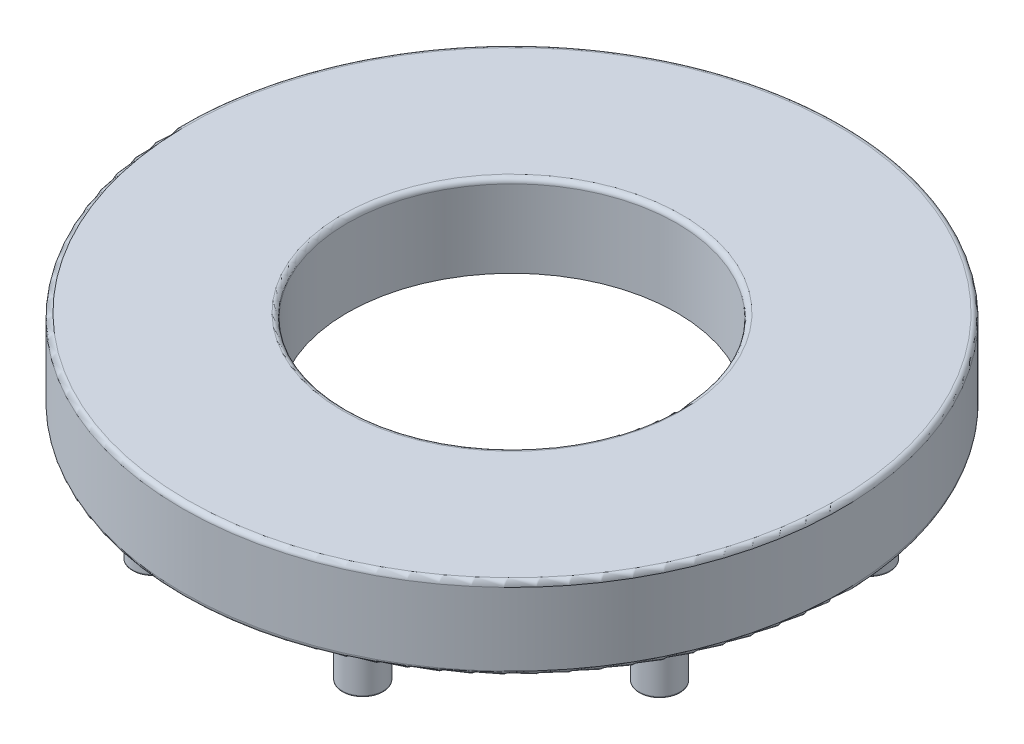
ISO-10303-21;
HEADER;
FILE_DESCRIPTION(('STEP AP214'),'2;1');
FILE_NAME('part.step','',(''),(''),'','','');
FILE_SCHEMA(('AUTOMOTIVE_DESIGN { 1 0 10303 214 1 1 1 1 }'));
ENDSEC;
DATA;
#1=APPLICATION_CONTEXT('core data for automotive mechanical design processes');
#2=APPLICATION_PROTOCOL_DEFINITION('international standard','automotive_design',2000,#1);
#3=PRODUCT_CONTEXT('',#1,'mechanical');
#4=PRODUCT('Part','Part','',(#3));
#5=PRODUCT_RELATED_PRODUCT_CATEGORY('part','',(#4));
#6=PRODUCT_DEFINITION_FORMATION('','',#4);
#7=PRODUCT_DEFINITION_CONTEXT('part definition',#1,'design');
#8=PRODUCT_DEFINITION('design','',#6,#7);
#9=PRODUCT_DEFINITION_SHAPE('','',#8);
#10=(LENGTH_UNIT() NAMED_UNIT(*) SI_UNIT(.MILLI.,.METRE.));
#11=(NAMED_UNIT(*) PLANE_ANGLE_UNIT() SI_UNIT($,.RADIAN.));
#12=(NAMED_UNIT(*) SI_UNIT($,.STERADIAN.) SOLID_ANGLE_UNIT());
#13=UNCERTAINTY_MEASURE_WITH_UNIT(LENGTH_MEASURE(1.E-05),#10,'distance_accuracy_value','');
#14=(GEOMETRIC_REPRESENTATION_CONTEXT(3) GLOBAL_UNCERTAINTY_ASSIGNED_CONTEXT((#13)) GLOBAL_UNIT_ASSIGNED_CONTEXT((#10,
#11,#12)) REPRESENTATION_CONTEXT('',''));
#15=CARTESIAN_POINT('',(0.,0.,0.));
#16=DIRECTION('',(0.,0.,1.));
#17=DIRECTION('',(1.,0.,0.));
#18=AXIS2_PLACEMENT_3D('',#15,#16,#17);
#19=CARTESIAN_POINT('',(0.,500.,0.));
#20=DIRECTION('',(0.,1.,0.));
#21=DIRECTION('',(0.,0.,1.));
#22=AXIS2_PLACEMENT_3D('',#19,#20,#21);
#23=PLANE('',#22);
#24=CARTESIAN_POINT('',(0.,500.,0.));
#25=DIRECTION('',(0.,1.,0.));
#26=DIRECTION('',(0.,0.,1.));
#27=AXIS2_PLACEMENT_3D('',#24,#25,#26);
#28=CIRCLE('',#27,1970.);
#29=CARTESIAN_POINT('',(0.,500.,1970.));
#30=VERTEX_POINT('',#29);
#31=EDGE_CURVE('E95',#30,#30,#28,.T.);
#32=ORIENTED_EDGE('',*,*,#31,.T.);
#33=EDGE_LOOP('',(#32));
#34=FACE_BOUND('',#33,.T.);
#35=CARTESIAN_POINT('',(0.,500.,0.));
#36=DIRECTION('',(0.,1.,0.));
#37=DIRECTION('',(0.,0.,1.));
#38=AXIS2_PLACEMENT_3D('',#35,#36,#37);
#39=CIRCLE('',#38,1030.);
#40=CARTESIAN_POINT('',(0.,500.,1030.));
#41=VERTEX_POINT('',#40);
#42=EDGE_CURVE('E98',#41,#41,#39,.F.);
#43=ORIENTED_EDGE('',*,*,#42,.T.);
#44=EDGE_LOOP('',(#43));
#45=FACE_BOUND('',#44,.T.);
#46=ADVANCED_FACE('F36',(#34,#45),#23,.T.);
#47=CARTESIAN_POINT('',(0.,0.,0.));
#48=DIRECTION('',(0.,1.,0.));
#49=DIRECTION('',(0.,0.,1.));
#50=AXIS2_PLACEMENT_3D('',#47,#48,#49);
#51=PLANE('',#50);
#52=CARTESIAN_POINT('',(0.,0.,0.));
#53=DIRECTION('',(0.,1.,0.));
#54=DIRECTION('',(0.,0.,1.));
#55=AXIS2_PLACEMENT_3D('',#52,#53,#54);
#56=CIRCLE('',#55,1970.);
#57=CARTESIAN_POINT('',(0.,0.,1970.));
#58=VERTEX_POINT('',#57);
#59=EDGE_CURVE('E101',#58,#58,#56,.F.);
#60=ORIENTED_EDGE('',*,*,#59,.T.);
#61=EDGE_LOOP('',(#60));
#62=FACE_BOUND('',#61,.T.);
#63=CARTESIAN_POINT('',(-1537.54351389656,0.,-641.811560674186));
#64=DIRECTION('',(0.,1.,0.));
#65=DIRECTION('',(0.,0.,1.));
#66=AXIS2_PLACEMENT_3D('',#63,#64,#65);
#67=CIRCLE('',#66,125.000000000194);
#68=CARTESIAN_POINT('',(-1537.54351389656,0.,-516.811560673992));
#69=VERTEX_POINT('',#68);
#70=EDGE_CURVE('E110',#69,#69,#67,.F.);
#71=ORIENTED_EDGE('',*,*,#70,.F.);
#72=EDGE_LOOP('',(#71));
#73=FACE_BOUND('',#72,.T.);
#74=CARTESIAN_POINT('',(-1537.54351389656,0.,631.942390176335));
#75=DIRECTION('',(0.,1.,0.));
#76=DIRECTION('',(0.,0.,1.));
#77=AXIS2_PLACEMENT_3D('',#74,#75,#76);
#78=CIRCLE('',#77,125.00000000019);
#79=CARTESIAN_POINT('',(-1537.54351389656,0.,756.942390176525));
#80=VERTEX_POINT('',#79);
#81=EDGE_CURVE('E113',#80,#80,#78,.F.);
#82=ORIENTED_EDGE('',*,*,#81,.F.);
#83=EDGE_LOOP('',(#82));
#84=FACE_BOUND('',#83,.T.);
#85=CARTESIAN_POINT('',(641.811560674298,0.,-1537.54351389671));
#86=DIRECTION('',(0.,1.,0.));
#87=DIRECTION('',(0.,0.,1.));
#88=AXIS2_PLACEMENT_3D('',#85,#86,#87);
#89=CIRCLE('',#88,125.000000000251);
#90=CARTESIAN_POINT('',(641.811560674298,0.,-1412.54351389646));
#91=VERTEX_POINT('',#90);
#92=EDGE_CURVE('E116',#91,#91,#89,.F.);
#93=ORIENTED_EDGE('',*,*,#92,.F.);
#94=EDGE_LOOP('',(#93));
#95=FACE_BOUND('',#94,.T.);
#96=CARTESIAN_POINT('',(-631.942390176224,0.,-1537.54351389671));
#97=DIRECTION('',(0.,1.,0.));
#98=DIRECTION('',(0.,0.,1.));
#99=AXIS2_PLACEMENT_3D('',#96,#97,#98);
#100=CIRCLE('',#99,125.000000000249);
#101=CARTESIAN_POINT('',(-631.942390176224,0.,-1412.54351389646));
#102=VERTEX_POINT('',#101);
#103=EDGE_CURVE('E119',#102,#102,#100,.F.);
#104=ORIENTED_EDGE('',*,*,#103,.F.);
#105=EDGE_LOOP('',(#104));
#106=FACE_BOUND('',#105,.T.);
#107=CARTESIAN_POINT('',(1537.54351389682,0.,641.811560674148));
#108=DIRECTION('',(0.,1.,0.));
#109=DIRECTION('',(0.,0.,1.));
#110=AXIS2_PLACEMENT_3D('',#107,#108,#109);
#111=CIRCLE('',#110,125.00000000007);
#112=CARTESIAN_POINT('',(1537.54351389682,0.,766.811560674217));
#113=VERTEX_POINT('',#112);
#114=EDGE_CURVE('E122',#113,#113,#111,.F.);
#115=ORIENTED_EDGE('',*,*,#114,.F.);
#116=EDGE_LOOP('',(#115));
#117=FACE_BOUND('',#116,.T.);
#118=CARTESIAN_POINT('',(1537.54351389682,0.,-631.942390176373));
#119=DIRECTION('',(0.,1.,0.));
#120=DIRECTION('',(0.,0.,1.));
#121=AXIS2_PLACEMENT_3D('',#118,#119,#120);
#122=CIRCLE('',#121,125.000000000068);
#123=CARTESIAN_POINT('',(1537.54351389682,0.,-506.942390176305));
#124=VERTEX_POINT('',#123);
#125=EDGE_CURVE('E125',#124,#124,#122,.F.);
#126=ORIENTED_EDGE('',*,*,#125,.F.);
#127=EDGE_LOOP('',(#126));
#128=FACE_BOUND('',#127,.T.);
#129=CARTESIAN_POINT('',(-641.811560674036,0.,1537.54351389667));
#130=DIRECTION('',(0.,1.,0.));
#131=DIRECTION('',(0.,0.,1.));
#132=AXIS2_PLACEMENT_3D('',#129,#130,#131);
#133=CIRCLE('',#132,125.);
#134=CARTESIAN_POINT('',(-641.811560674036,0.,1662.54351389667));
#135=VERTEX_POINT('',#134);
#136=EDGE_CURVE('E128',#135,#135,#133,.F.);
#137=ORIENTED_EDGE('',*,*,#136,.F.);
#138=EDGE_LOOP('',(#137));
#139=FACE_BOUND('',#138,.T.);
#140=CARTESIAN_POINT('',(631.942390176486,0.,1537.54351389667));
#141=DIRECTION('',(0.,1.,0.));
#142=DIRECTION('',(0.,0.,1.));
#143=AXIS2_PLACEMENT_3D('',#140,#141,#142);
#144=CIRCLE('',#143,125.);
#145=CARTESIAN_POINT('',(631.942390176486,0.,1662.54351389667));
#146=VERTEX_POINT('',#145);
#147=EDGE_CURVE('E131',#146,#146,#144,.F.);
#148=ORIENTED_EDGE('',*,*,#147,.F.);
#149=EDGE_LOOP('',(#148));
#150=FACE_BOUND('',#149,.T.);
#151=CARTESIAN_POINT('',(0.,0.,0.));
#152=DIRECTION('',(0.,1.,0.));
#153=DIRECTION('',(0.,0.,1.));
#154=AXIS2_PLACEMENT_3D('',#151,#152,#153);
#155=CIRCLE('',#154,1000.);
#156=CARTESIAN_POINT('',(0.,0.,1000.));
#157=VERTEX_POINT('',#156);
#158=EDGE_CURVE('E134',#157,#157,#155,.T.);
#159=ORIENTED_EDGE('',*,*,#158,.T.);
#160=EDGE_LOOP('',(#159));
#161=FACE_BOUND('',#160,.T.);
#162=ADVANCED_FACE('F138',(#62,#73,#84,#95,#106,#117,#128,#139,#150,#161),#51,.F.);
#163=CARTESIAN_POINT('',(0.,500.,0.));
#164=DIRECTION('',(0.,-1.,0.));
#165=DIRECTION('',(0.,0.,-1.));
#166=AXIS2_PLACEMENT_3D('',#163,#164,#165);
#167=CYLINDRICAL_SURFACE('',#166,2000.);
#168=CARTESIAN_POINT('',(0.,30.,0.));
#169=DIRECTION('',(0.,1.,0.));
#170=DIRECTION('',(0.,0.,1.));
#171=AXIS2_PLACEMENT_3D('',#168,#169,#170);
#172=CIRCLE('',#171,2000.);
#173=CARTESIAN_POINT('',(0.,30.,2000.));
#174=VERTEX_POINT('',#173);
#175=EDGE_CURVE('E104',#174,#174,#172,.T.);
#176=ORIENTED_EDGE('',*,*,#175,.T.);
#177=EDGE_LOOP('',(#176));
#178=FACE_BOUND('',#177,.T.);
#179=CARTESIAN_POINT('',(0.,470.,0.));
#180=DIRECTION('',(0.,1.,0.));
#181=DIRECTION('',(0.,0.,1.));
#182=AXIS2_PLACEMENT_3D('',#179,#180,#181);
#183=CIRCLE('',#182,2000.);
#184=CARTESIAN_POINT('',(0.,470.,2000.));
#185=VERTEX_POINT('',#184);
#186=EDGE_CURVE('E107',#185,#185,#183,.F.);
#187=ORIENTED_EDGE('',*,*,#186,.T.);
#188=EDGE_LOOP('',(#187));
#189=FACE_BOUND('',#188,.T.);
#190=ADVANCED_FACE('F143',(#178,#189),#167,.T.);
#191=CARTESIAN_POINT('',(0.,500.,0.));
#192=DIRECTION('',(0.,-1.,0.));
#193=DIRECTION('',(0.,0.,-1.));
#194=AXIS2_PLACEMENT_3D('',#191,#192,#193);
#195=CYLINDRICAL_SURFACE('',#194,1000.);
#196=CARTESIAN_POINT('',(0.,470.,0.));
#197=DIRECTION('',(0.,1.,0.));
#198=DIRECTION('',(0.,0.,1.));
#199=AXIS2_PLACEMENT_3D('',#196,#197,#198);
#200=CIRCLE('',#199,1000.);
#201=CARTESIAN_POINT('',(0.,470.,1000.));
#202=VERTEX_POINT('',#201);
#203=EDGE_CURVE('E92',#202,#202,#200,.T.);
#204=ORIENTED_EDGE('',*,*,#203,.T.);
#205=EDGE_LOOP('',(#204));
#206=FACE_BOUND('',#205,.T.);
#207=ORIENTED_EDGE('',*,*,#158,.F.);
#208=EDGE_LOOP('',(#207));
#209=FACE_BOUND('',#208,.T.);
#210=ADVANCED_FACE('F140',(#206,#209),#195,.F.);
#211=CARTESIAN_POINT('',(631.942390176486,-350.,1537.54351389667));
#212=DIRECTION('',(0.,1.,0.));
#213=DIRECTION('',(0.,0.,1.));
#214=AXIS2_PLACEMENT_3D('',#211,#212,#213);
#215=CYLINDRICAL_SURFACE('',#214,125.);
#216=CARTESIAN_POINT('',(631.942390176486,-340.,1537.54351389667));
#217=DIRECTION('',(0.,-1.,0.));
#218=DIRECTION('',(0.,0.,-1.));
#219=AXIS2_PLACEMENT_3D('',#216,#217,#218);
#220=CIRCLE('',#219,125.);
#221=CARTESIAN_POINT('',(631.942390176486,-340.,1412.54351389667));
#222=VERTEX_POINT('',#221);
#223=EDGE_CURVE('E47',#222,#222,#220,.F.);
#224=ORIENTED_EDGE('',*,*,#223,.T.);
#225=EDGE_LOOP('',(#224));
#226=FACE_BOUND('',#225,.T.);
#227=ORIENTED_EDGE('',*,*,#147,.T.);
#228=EDGE_LOOP('',(#227));
#229=FACE_BOUND('',#228,.T.);
#230=ADVANCED_FACE('F142',(#226,#229),#215,.T.);
#231=CARTESIAN_POINT('',(631.942390176486,-350.,1537.54351389667));
#232=DIRECTION('',(0.,-1.,0.));
#233=DIRECTION('',(0.,0.,-1.));
#234=AXIS2_PLACEMENT_3D('',#231,#232,#233);
#235=PLANE('',#234);
#236=CARTESIAN_POINT('',(631.942390176486,-350.,1537.54351389667));
#237=DIRECTION('',(0.,-1.,0.));
#238=DIRECTION('',(0.,0.,-1.));
#239=AXIS2_PLACEMENT_3D('',#236,#237,#238);
#240=CIRCLE('',#239,115.);
#241=CARTESIAN_POINT('',(631.942390176486,-350.,1422.54351389667));
#242=VERTEX_POINT('',#241);
#243=EDGE_CURVE('E51',#242,#242,#240,.T.);
#244=ORIENTED_EDGE('',*,*,#243,.T.);
#245=EDGE_LOOP('',(#244));
#246=FACE_BOUND('',#245,.T.);
#247=ADVANCED_FACE('F150',(#246),#235,.T.);
#248=CARTESIAN_POINT('',(-641.811560674036,-350.,1537.54351389667));
#249=DIRECTION('',(0.,1.,0.));
#250=DIRECTION('',(0.,0.,1.));
#251=AXIS2_PLACEMENT_3D('',#248,#249,#250);
#252=CYLINDRICAL_SURFACE('',#251,125.);
#253=CARTESIAN_POINT('',(-641.811560674036,-340.,1537.54351389667));
#254=DIRECTION('',(0.,-1.,0.));
#255=DIRECTION('',(0.,0.,-1.));
#256=AXIS2_PLACEMENT_3D('',#253,#254,#255);
#257=CIRCLE('',#256,125.);
#258=CARTESIAN_POINT('',(-641.811560674036,-340.,1412.54351389667));
#259=VERTEX_POINT('',#258);
#260=EDGE_CURVE('E10',#259,#259,#257,.F.);
#261=ORIENTED_EDGE('',*,*,#260,.T.);
#262=EDGE_LOOP('',(#261));
#263=FACE_BOUND('',#262,.T.);
#264=ORIENTED_EDGE('',*,*,#136,.T.);
#265=EDGE_LOOP('',(#264));
#266=FACE_BOUND('',#265,.T.);
#267=ADVANCED_FACE('F213',(#263,#266),#252,.T.);
#268=CARTESIAN_POINT('',(-641.811560674036,-350.,1537.54351389667));
#269=DIRECTION('',(0.,-1.,0.));
#270=DIRECTION('',(0.,0.,-1.));
#271=AXIS2_PLACEMENT_3D('',#268,#269,#270);
#272=PLANE('',#271);
#273=CARTESIAN_POINT('',(-641.811560674036,-350.,1537.54351389667));
#274=DIRECTION('',(0.,-1.,0.));
#275=DIRECTION('',(0.,0.,-1.));
#276=AXIS2_PLACEMENT_3D('',#273,#274,#275);
#277=CIRCLE('',#276,115.);
#278=CARTESIAN_POINT('',(-641.811560674036,-350.,1422.54351389667));
#279=VERTEX_POINT('',#278);
#280=EDGE_CURVE('E43',#279,#279,#277,.T.);
#281=ORIENTED_EDGE('',*,*,#280,.T.);
#282=EDGE_LOOP('',(#281));
#283=FACE_BOUND('',#282,.T.);
#284=ADVANCED_FACE('F218',(#283),#272,.T.);
#285=CARTESIAN_POINT('',(1537.54351389682,-350.,-631.942390176373));
#286=DIRECTION('',(0.,1.,0.));
#287=DIRECTION('',(0.,0.,1.));
#288=AXIS2_PLACEMENT_3D('',#285,#286,#287);
#289=CYLINDRICAL_SURFACE('',#288,125.000000000068);
#290=CARTESIAN_POINT('',(1537.54351389682,-340.,-631.942390176373));
#291=DIRECTION('',(0.,-1.,0.));
#292=DIRECTION('',(0.,0.,-1.));
#293=AXIS2_PLACEMENT_3D('',#290,#291,#292);
#294=CIRCLE('',#293,125.000000000068);
#295=CARTESIAN_POINT('',(1537.54351389682,-340.,-756.942390176442));
#296=VERTEX_POINT('',#295);
#297=EDGE_CURVE('E62',#296,#296,#294,.F.);
#298=ORIENTED_EDGE('',*,*,#297,.T.);
#299=EDGE_LOOP('',(#298));
#300=FACE_BOUND('',#299,.T.);
#301=ORIENTED_EDGE('',*,*,#125,.T.);
#302=EDGE_LOOP('',(#301));
#303=FACE_BOUND('',#302,.T.);
#304=ADVANCED_FACE('F222',(#300,#303),#289,.T.);
#305=CARTESIAN_POINT('',(1537.54351389682,-350.,-631.942390176373));
#306=DIRECTION('',(0.,-1.,0.));
#307=DIRECTION('',(0.,0.,-1.));
#308=AXIS2_PLACEMENT_3D('',#305,#306,#307);
#309=PLANE('',#308);
#310=CARTESIAN_POINT('',(1537.54351389682,-350.,-631.942390176373));
#311=DIRECTION('',(0.,-1.,0.));
#312=DIRECTION('',(0.,0.,-1.));
#313=AXIS2_PLACEMENT_3D('',#310,#311,#312);
#314=CIRCLE('',#313,115.000000000068);
#315=CARTESIAN_POINT('',(1537.54351389682,-350.,-746.942390176442));
#316=VERTEX_POINT('',#315);
#317=EDGE_CURVE('E65',#316,#316,#314,.T.);
#318=ORIENTED_EDGE('',*,*,#317,.T.);
#319=EDGE_LOOP('',(#318));
#320=FACE_BOUND('',#319,.T.);
#321=ADVANCED_FACE('F224',(#320),#309,.T.);
#322=CARTESIAN_POINT('',(1537.54351389682,-350.,641.811560674148));
#323=DIRECTION('',(0.,1.,0.));
#324=DIRECTION('',(0.,0.,1.));
#325=AXIS2_PLACEMENT_3D('',#322,#323,#324);
#326=CYLINDRICAL_SURFACE('',#325,125.00000000007);
#327=CARTESIAN_POINT('',(1537.54351389682,-340.,641.811560674148));
#328=DIRECTION('',(0.,-1.,0.));
#329=DIRECTION('',(0.,0.,-1.));
#330=AXIS2_PLACEMENT_3D('',#327,#328,#329);
#331=CIRCLE('',#330,125.00000000007);
#332=CARTESIAN_POINT('',(1537.54351389682,-340.,516.811560674078));
#333=VERTEX_POINT('',#332);
#334=EDGE_CURVE('E56',#333,#333,#331,.F.);
#335=ORIENTED_EDGE('',*,*,#334,.T.);
#336=EDGE_LOOP('',(#335));
#337=FACE_BOUND('',#336,.T.);
#338=ORIENTED_EDGE('',*,*,#114,.T.);
#339=EDGE_LOOP('',(#338));
#340=FACE_BOUND('',#339,.T.);
#341=ADVANCED_FACE('F227',(#337,#340),#326,.T.);
#342=CARTESIAN_POINT('',(1537.54351389682,-350.,641.811560674148));
#343=DIRECTION('',(0.,-1.,0.));
#344=DIRECTION('',(0.,0.,-1.));
#345=AXIS2_PLACEMENT_3D('',#342,#343,#344);
#346=PLANE('',#345);
#347=CARTESIAN_POINT('',(1537.54351389682,-350.,641.811560674148));
#348=DIRECTION('',(0.,-1.,0.));
#349=DIRECTION('',(0.,0.,-1.));
#350=AXIS2_PLACEMENT_3D('',#347,#348,#349);
#351=CIRCLE('',#350,115.00000000007);
#352=CARTESIAN_POINT('',(1537.54351389682,-350.,526.811560674078));
#353=VERTEX_POINT('',#352);
#354=EDGE_CURVE('E59',#353,#353,#351,.T.);
#355=ORIENTED_EDGE('',*,*,#354,.T.);
#356=EDGE_LOOP('',(#355));
#357=FACE_BOUND('',#356,.T.);
#358=ADVANCED_FACE('F232',(#357),#346,.T.);
#359=CARTESIAN_POINT('',(-631.942390176224,-350.,-1537.54351389671));
#360=DIRECTION('',(0.,1.,0.));
#361=DIRECTION('',(0.,0.,1.));
#362=AXIS2_PLACEMENT_3D('',#359,#360,#361);
#363=CYLINDRICAL_SURFACE('',#362,125.000000000249);
#364=CARTESIAN_POINT('',(-631.942390176224,-340.,-1537.54351389671));
#365=DIRECTION('',(0.,-1.,0.));
#366=DIRECTION('',(0.,0.,-1.));
#367=AXIS2_PLACEMENT_3D('',#364,#365,#366);
#368=CIRCLE('',#367,125.000000000249);
#369=CARTESIAN_POINT('',(-631.942390176224,-340.,-1662.54351389696));
#370=VERTEX_POINT('',#369);
#371=EDGE_CURVE('E74',#370,#370,#368,.F.);
#372=ORIENTED_EDGE('',*,*,#371,.T.);
#373=EDGE_LOOP('',(#372));
#374=FACE_BOUND('',#373,.T.);
#375=ORIENTED_EDGE('',*,*,#103,.T.);
#376=EDGE_LOOP('',(#375));
#377=FACE_BOUND('',#376,.T.);
#378=ADVANCED_FACE('F235',(#374,#377),#363,.T.);
#379=CARTESIAN_POINT('',(-631.942390176224,-350.,-1537.54351389671));
#380=DIRECTION('',(0.,-1.,0.));
#381=DIRECTION('',(0.,0.,-1.));
#382=AXIS2_PLACEMENT_3D('',#379,#380,#381);
#383=PLANE('',#382);
#384=CARTESIAN_POINT('',(-631.942390176224,-350.,-1537.54351389671));
#385=DIRECTION('',(0.,-1.,0.));
#386=DIRECTION('',(0.,0.,-1.));
#387=AXIS2_PLACEMENT_3D('',#384,#385,#386);
#388=CIRCLE('',#387,115.000000000249);
#389=CARTESIAN_POINT('',(-631.942390176224,-350.,-1652.54351389696));
#390=VERTEX_POINT('',#389);
#391=EDGE_CURVE('E77',#390,#390,#388,.T.);
#392=ORIENTED_EDGE('',*,*,#391,.T.);
#393=EDGE_LOOP('',(#392));
#394=FACE_BOUND('',#393,.T.);
#395=ADVANCED_FACE('F240',(#394),#383,.T.);
#396=CARTESIAN_POINT('',(641.811560674298,-350.,-1537.54351389671));
#397=DIRECTION('',(0.,1.,0.));
#398=DIRECTION('',(0.,0.,1.));
#399=AXIS2_PLACEMENT_3D('',#396,#397,#398);
#400=CYLINDRICAL_SURFACE('',#399,125.000000000251);
#401=CARTESIAN_POINT('',(641.811560674298,-340.,-1537.54351389671));
#402=DIRECTION('',(0.,-1.,0.));
#403=DIRECTION('',(0.,0.,-1.));
#404=AXIS2_PLACEMENT_3D('',#401,#402,#403);
#405=CIRCLE('',#404,125.000000000251);
#406=CARTESIAN_POINT('',(641.811560674298,-340.,-1662.54351389696));
#407=VERTEX_POINT('',#406);
#408=EDGE_CURVE('E68',#407,#407,#405,.F.);
#409=ORIENTED_EDGE('',*,*,#408,.T.);
#410=EDGE_LOOP('',(#409));
#411=FACE_BOUND('',#410,.T.);
#412=ORIENTED_EDGE('',*,*,#92,.T.);
#413=EDGE_LOOP('',(#412));
#414=FACE_BOUND('',#413,.T.);
#415=ADVANCED_FACE('F243',(#411,#414),#400,.T.);
#416=CARTESIAN_POINT('',(641.811560674298,-350.,-1537.54351389671));
#417=DIRECTION('',(0.,-1.,0.));
#418=DIRECTION('',(0.,0.,-1.));
#419=AXIS2_PLACEMENT_3D('',#416,#417,#418);
#420=PLANE('',#419);
#421=CARTESIAN_POINT('',(641.811560674298,-350.,-1537.54351389671));
#422=DIRECTION('',(0.,-1.,0.));
#423=DIRECTION('',(0.,0.,-1.));
#424=AXIS2_PLACEMENT_3D('',#421,#422,#423);
#425=CIRCLE('',#424,115.000000000251);
#426=CARTESIAN_POINT('',(641.811560674298,-350.,-1652.54351389696));
#427=VERTEX_POINT('',#426);
#428=EDGE_CURVE('E71',#427,#427,#425,.T.);
#429=ORIENTED_EDGE('',*,*,#428,.T.);
#430=EDGE_LOOP('',(#429));
#431=FACE_BOUND('',#430,.T.);
#432=ADVANCED_FACE('F248',(#431),#420,.T.);
#433=CARTESIAN_POINT('',(-1537.54351389656,-350.,631.942390176335));
#434=DIRECTION('',(0.,1.,0.));
#435=DIRECTION('',(0.,0.,1.));
#436=AXIS2_PLACEMENT_3D('',#433,#434,#435);
#437=CYLINDRICAL_SURFACE('',#436,125.00000000019);
#438=CARTESIAN_POINT('',(-1537.54351389656,-340.,631.942390176335));
#439=DIRECTION('',(0.,-1.,0.));
#440=DIRECTION('',(0.,0.,-1.));
#441=AXIS2_PLACEMENT_3D('',#438,#439,#440);
#442=CIRCLE('',#441,125.00000000019);
#443=CARTESIAN_POINT('',(-1537.54351389656,-340.,506.942390176146));
#444=VERTEX_POINT('',#443);
#445=EDGE_CURVE('E86',#444,#444,#442,.F.);
#446=ORIENTED_EDGE('',*,*,#445,.T.);
#447=EDGE_LOOP('',(#446));
#448=FACE_BOUND('',#447,.T.);
#449=ORIENTED_EDGE('',*,*,#81,.T.);
#450=EDGE_LOOP('',(#449));
#451=FACE_BOUND('',#450,.T.);
#452=ADVANCED_FACE('F251',(#448,#451),#437,.T.);
#453=CARTESIAN_POINT('',(-1537.54351389656,-350.,631.942390176335));
#454=DIRECTION('',(0.,-1.,0.));
#455=DIRECTION('',(0.,0.,-1.));
#456=AXIS2_PLACEMENT_3D('',#453,#454,#455);
#457=PLANE('',#456);
#458=CARTESIAN_POINT('',(-1537.54351389656,-350.,631.942390176335));
#459=DIRECTION('',(0.,-1.,0.));
#460=DIRECTION('',(0.,0.,-1.));
#461=AXIS2_PLACEMENT_3D('',#458,#459,#460);
#462=CIRCLE('',#461,115.00000000019);
#463=CARTESIAN_POINT('',(-1537.54351389656,-350.,516.942390176146));
#464=VERTEX_POINT('',#463);
#465=EDGE_CURVE('E89',#464,#464,#462,.T.);
#466=ORIENTED_EDGE('',*,*,#465,.T.);
#467=EDGE_LOOP('',(#466));
#468=FACE_BOUND('',#467,.T.);
#469=ADVANCED_FACE('F256',(#468),#457,.T.);
#470=CARTESIAN_POINT('',(-1537.54351389656,-350.,-641.811560674186));
#471=DIRECTION('',(0.,1.,0.));
#472=DIRECTION('',(0.,0.,1.));
#473=AXIS2_PLACEMENT_3D('',#470,#471,#472);
#474=CYLINDRICAL_SURFACE('',#473,125.000000000194);
#475=CARTESIAN_POINT('',(-1537.54351389656,-340.,-641.811560674186));
#476=DIRECTION('',(0.,-1.,0.));
#477=DIRECTION('',(0.,0.,-1.));
#478=AXIS2_PLACEMENT_3D('',#475,#476,#477);
#479=CIRCLE('',#478,125.000000000194);
#480=CARTESIAN_POINT('',(-1537.54351389656,-340.,-766.81156067438));
#481=VERTEX_POINT('',#480);
#482=EDGE_CURVE('E80',#481,#481,#479,.F.);
#483=ORIENTED_EDGE('',*,*,#482,.T.);
#484=EDGE_LOOP('',(#483));
#485=FACE_BOUND('',#484,.T.);
#486=ORIENTED_EDGE('',*,*,#70,.T.);
#487=EDGE_LOOP('',(#486));
#488=FACE_BOUND('',#487,.T.);
#489=ADVANCED_FACE('F259',(#485,#488),#474,.T.);
#490=CARTESIAN_POINT('',(-1537.54351389656,-350.,-641.811560674186));
#491=DIRECTION('',(0.,-1.,0.));
#492=DIRECTION('',(0.,0.,-1.));
#493=AXIS2_PLACEMENT_3D('',#490,#491,#492);
#494=PLANE('',#493);
#495=CARTESIAN_POINT('',(-1537.54351389656,-350.,-641.811560674186));
#496=DIRECTION('',(0.,-1.,0.));
#497=DIRECTION('',(0.,0.,-1.));
#498=AXIS2_PLACEMENT_3D('',#495,#496,#497);
#499=CIRCLE('',#498,115.000000000194);
#500=CARTESIAN_POINT('',(-1537.54351389656,-350.,-756.81156067438));
#501=VERTEX_POINT('',#500);
#502=EDGE_CURVE('E83',#501,#501,#499,.T.);
#503=ORIENTED_EDGE('',*,*,#502,.T.);
#504=EDGE_LOOP('',(#503));
#505=FACE_BOUND('',#504,.T.);
#506=ADVANCED_FACE('F169',(#505),#494,.T.);
#507=CARTESIAN_POINT('',(0.,30.,0.));
#508=DIRECTION('',(0.,1.,0.));
#509=DIRECTION('',(0.,0.,1.));
#510=AXIS2_PLACEMENT_3D('',#507,#508,#509);
#511=TOROIDAL_SURFACE('',#510,1970.,30.);
#512=ORIENTED_EDGE('',*,*,#59,.F.);
#513=EDGE_LOOP('',(#512));
#514=FACE_BOUND('',#513,.T.);
#515=ORIENTED_EDGE('',*,*,#175,.F.);
#516=EDGE_LOOP('',(#515));
#517=FACE_BOUND('',#516,.T.);
#518=ADVANCED_FACE('F165',(#514,#517),#511,.T.);
#519=CARTESIAN_POINT('',(0.,470.,0.));
#520=DIRECTION('',(0.,1.,0.));
#521=DIRECTION('',(0.,0.,1.));
#522=AXIS2_PLACEMENT_3D('',#519,#520,#521);
#523=TOROIDAL_SURFACE('',#522,1970.,30.);
#524=ORIENTED_EDGE('',*,*,#186,.F.);
#525=EDGE_LOOP('',(#524));
#526=FACE_BOUND('',#525,.T.);
#527=ORIENTED_EDGE('',*,*,#31,.F.);
#528=EDGE_LOOP('',(#527));
#529=FACE_BOUND('',#528,.T.);
#530=ADVANCED_FACE('F168',(#526,#529),#523,.T.);
#531=CARTESIAN_POINT('',(0.,470.,0.));
#532=DIRECTION('',(0.,1.,0.));
#533=DIRECTION('',(0.,0.,1.));
#534=AXIS2_PLACEMENT_3D('',#531,#532,#533);
#535=TOROIDAL_SURFACE('',#534,1030.,30.);
#536=ORIENTED_EDGE('',*,*,#42,.F.);
#537=EDGE_LOOP('',(#536));
#538=FACE_BOUND('',#537,.T.);
#539=ORIENTED_EDGE('',*,*,#203,.F.);
#540=EDGE_LOOP('',(#539));
#541=FACE_BOUND('',#540,.T.);
#542=ADVANCED_FACE('F173',(#538,#541),#535,.T.);
#543=CARTESIAN_POINT('',(-1537.54351389656,-340.,631.942390176335));
#544=DIRECTION('',(0.,-1.,0.));
#545=DIRECTION('',(0.,0.,-1.));
#546=AXIS2_PLACEMENT_3D('',#543,#544,#545);
#547=TOROIDAL_SURFACE('',#546,115.00000000019,10.);
#548=ORIENTED_EDGE('',*,*,#445,.F.);
#549=EDGE_LOOP('',(#548));
#550=FACE_BOUND('',#549,.T.);
#551=ORIENTED_EDGE('',*,*,#465,.F.);
#552=EDGE_LOOP('',(#551));
#553=FACE_BOUND('',#552,.T.);
#554=ADVANCED_FACE('F177',(#550,#553),#547,.T.);
#555=CARTESIAN_POINT('',(-1537.54351389656,-340.,-641.811560674186));
#556=DIRECTION('',(0.,-1.,0.));
#557=DIRECTION('',(0.,0.,-1.));
#558=AXIS2_PLACEMENT_3D('',#555,#556,#557);
#559=TOROIDAL_SURFACE('',#558,115.000000000194,10.);
#560=ORIENTED_EDGE('',*,*,#482,.F.);
#561=EDGE_LOOP('',(#560));
#562=FACE_BOUND('',#561,.T.);
#563=ORIENTED_EDGE('',*,*,#502,.F.);
#564=EDGE_LOOP('',(#563));
#565=FACE_BOUND('',#564,.T.);
#566=ADVANCED_FACE('F181',(#562,#565),#559,.T.);
#567=CARTESIAN_POINT('',(-631.942390176224,-340.,-1537.54351389671));
#568=DIRECTION('',(0.,-1.,0.));
#569=DIRECTION('',(0.,0.,-1.));
#570=AXIS2_PLACEMENT_3D('',#567,#568,#569);
#571=TOROIDAL_SURFACE('',#570,115.000000000249,10.);
#572=ORIENTED_EDGE('',*,*,#371,.F.);
#573=EDGE_LOOP('',(#572));
#574=FACE_BOUND('',#573,.T.);
#575=ORIENTED_EDGE('',*,*,#391,.F.);
#576=EDGE_LOOP('',(#575));
#577=FACE_BOUND('',#576,.T.);
#578=ADVANCED_FACE('F185',(#574,#577),#571,.T.);
#579=CARTESIAN_POINT('',(641.811560674298,-340.,-1537.54351389671));
#580=DIRECTION('',(0.,-1.,0.));
#581=DIRECTION('',(0.,0.,-1.));
#582=AXIS2_PLACEMENT_3D('',#579,#580,#581);
#583=TOROIDAL_SURFACE('',#582,115.000000000251,10.);
#584=ORIENTED_EDGE('',*,*,#408,.F.);
#585=EDGE_LOOP('',(#584));
#586=FACE_BOUND('',#585,.T.);
#587=ORIENTED_EDGE('',*,*,#428,.F.);
#588=EDGE_LOOP('',(#587));
#589=FACE_BOUND('',#588,.T.);
#590=ADVANCED_FACE('F189',(#586,#589),#583,.T.);
#591=CARTESIAN_POINT('',(1537.54351389682,-340.,-631.942390176373));
#592=DIRECTION('',(0.,-1.,0.));
#593=DIRECTION('',(0.,0.,-1.));
#594=AXIS2_PLACEMENT_3D('',#591,#592,#593);
#595=TOROIDAL_SURFACE('',#594,115.000000000068,10.);
#596=ORIENTED_EDGE('',*,*,#297,.F.);
#597=EDGE_LOOP('',(#596));
#598=FACE_BOUND('',#597,.T.);
#599=ORIENTED_EDGE('',*,*,#317,.F.);
#600=EDGE_LOOP('',(#599));
#601=FACE_BOUND('',#600,.T.);
#602=ADVANCED_FACE('F193',(#598,#601),#595,.T.);
#603=CARTESIAN_POINT('',(1537.54351389682,-340.,641.811560674148));
#604=DIRECTION('',(0.,-1.,0.));
#605=DIRECTION('',(0.,0.,-1.));
#606=AXIS2_PLACEMENT_3D('',#603,#604,#605);
#607=TOROIDAL_SURFACE('',#606,115.00000000007,10.);
#608=ORIENTED_EDGE('',*,*,#334,.F.);
#609=EDGE_LOOP('',(#608));
#610=FACE_BOUND('',#609,.T.);
#611=ORIENTED_EDGE('',*,*,#354,.F.);
#612=EDGE_LOOP('',(#611));
#613=FACE_BOUND('',#612,.T.);
#614=ADVANCED_FACE('F197',(#610,#613),#607,.T.);
#615=CARTESIAN_POINT('',(631.942390176486,-340.,1537.54351389667));
#616=DIRECTION('',(0.,-1.,0.));
#617=DIRECTION('',(0.,0.,-1.));
#618=AXIS2_PLACEMENT_3D('',#615,#616,#617);
#619=TOROIDAL_SURFACE('',#618,115.,10.);
#620=ORIENTED_EDGE('',*,*,#223,.F.);
#621=EDGE_LOOP('',(#620));
#622=FACE_BOUND('',#621,.T.);
#623=ORIENTED_EDGE('',*,*,#243,.F.);
#624=EDGE_LOOP('',(#623));
#625=FACE_BOUND('',#624,.T.);
#626=ADVANCED_FACE('F200',(#622,#625),#619,.T.);
#627=CARTESIAN_POINT('',(-641.811560674036,-340.,1537.54351389667));
#628=DIRECTION('',(0.,-1.,0.));
#629=DIRECTION('',(0.,0.,-1.));
#630=AXIS2_PLACEMENT_3D('',#627,#628,#629);
#631=TOROIDAL_SURFACE('',#630,115.,10.);
#632=ORIENTED_EDGE('',*,*,#260,.F.);
#633=EDGE_LOOP('',(#632));
#634=FACE_BOUND('',#633,.T.);
#635=ORIENTED_EDGE('',*,*,#280,.F.);
#636=EDGE_LOOP('',(#635));
#637=FACE_BOUND('',#636,.T.);
#638=ADVANCED_FACE('F38',(#634,#637),#631,.T.);
#639=CLOSED_SHELL('',(#46,#162,#190,#210,#230,#247,#267,#284,#304,#321,#341,#358,#378,#395,#415,
#432,#452,#469,#489,#506,#518,#530,#542,#554,#566,#578,#590,#602,#614,#626,#638));
#640=MANIFOLD_SOLID_BREP('B2',#639);
#641=ADVANCED_BREP_SHAPE_REPRESENTATION('',(#18,#640),#14);
#642=SHAPE_DEFINITION_REPRESENTATION(#9,#641);
ENDSEC;
END-ISO-10303-21;
